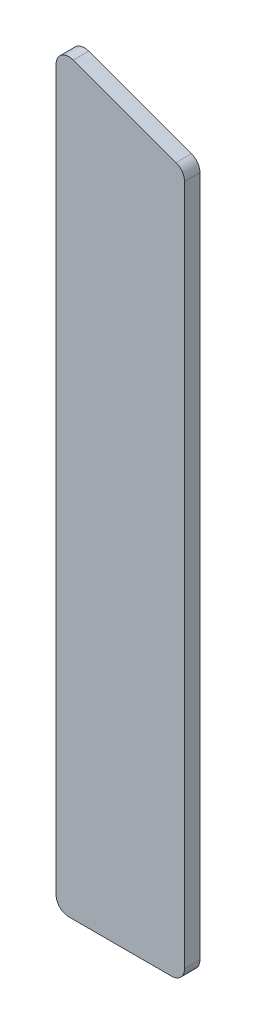
ISO-10303-21;
HEADER;
FILE_DESCRIPTION(('STEP AP214'),'2;1');
FILE_NAME('part.step','',(''),(''),'','','');
FILE_SCHEMA(('AUTOMOTIVE_DESIGN { 1 0 10303 214 1 1 1 1 }'));
ENDSEC;
DATA;
#1=APPLICATION_CONTEXT('core data for automotive mechanical design processes');
#2=APPLICATION_PROTOCOL_DEFINITION('international standard','automotive_design',2000,#1);
#3=PRODUCT_CONTEXT('',#1,'mechanical');
#4=PRODUCT('Part','Part','',(#3));
#5=PRODUCT_RELATED_PRODUCT_CATEGORY('part','',(#4));
#6=PRODUCT_DEFINITION_FORMATION('','',#4);
#7=PRODUCT_DEFINITION_CONTEXT('part definition',#1,'design');
#8=PRODUCT_DEFINITION('design','',#6,#7);
#9=PRODUCT_DEFINITION_SHAPE('','',#8);
#10=(LENGTH_UNIT() NAMED_UNIT(*) SI_UNIT(.MILLI.,.METRE.));
#11=(NAMED_UNIT(*) PLANE_ANGLE_UNIT() SI_UNIT($,.RADIAN.));
#12=(NAMED_UNIT(*) SI_UNIT($,.STERADIAN.) SOLID_ANGLE_UNIT());
#13=UNCERTAINTY_MEASURE_WITH_UNIT(LENGTH_MEASURE(1.E-05),#10,'distance_accuracy_value','');
#14=(GEOMETRIC_REPRESENTATION_CONTEXT(3) GLOBAL_UNCERTAINTY_ASSIGNED_CONTEXT((#13)) GLOBAL_UNIT_ASSIGNED_CONTEXT((#10,
#11,#12)) REPRESENTATION_CONTEXT('',''));
#15=CARTESIAN_POINT('',(0.,0.,0.));
#16=DIRECTION('',(0.,0.,1.));
#17=DIRECTION('',(1.,0.,0.));
#18=AXIS2_PLACEMENT_3D('',#15,#16,#17);
#19=CARTESIAN_POINT('',(20.,5.,6.));
#20=DIRECTION('',(0.,0.,-1.));
#21=DIRECTION('',(-1.,0.,0.));
#22=AXIS2_PLACEMENT_3D('',#19,#20,#21);
#23=CYLINDRICAL_SURFACE('',#22,5.);
#24=CARTESIAN_POINT('',(20.,5.,0.));
#25=DIRECTION('',(0.,0.,1.));
#26=DIRECTION('',(-1.,0.,0.));
#27=AXIS2_PLACEMENT_3D('',#24,#25,#26);
#28=CIRCLE('',#27,5.);
#29=CARTESIAN_POINT('',(20.,0.,0.));
#30=VERTEX_POINT('',#29);
#31=CARTESIAN_POINT('',(25.,5.,0.));
#32=VERTEX_POINT('',#31);
#33=EDGE_CURVE('E135',#30,#32,#28,.T.);
#34=ORIENTED_EDGE('',*,*,#33,.T.);
#35=DIRECTION('',(0.,0.,-1.));
#36=VECTOR('',#35,1.);
#37=CARTESIAN_POINT('',(25.,5.,6.));
#38=LINE('',#37,#36);
#39=CARTESIAN_POINT('',(25.,5.,6.));
#40=VERTEX_POINT('',#39);
#41=EDGE_CURVE('E11',#40,#32,#38,.T.);
#42=ORIENTED_EDGE('',*,*,#41,.F.);
#43=CARTESIAN_POINT('',(20.,5.,6.));
#44=DIRECTION('',(0.,0.,1.));
#45=DIRECTION('',(-1.,0.,0.));
#46=AXIS2_PLACEMENT_3D('',#43,#44,#45);
#47=CIRCLE('',#46,5.);
#48=CARTESIAN_POINT('',(20.,0.,6.));
#49=VERTEX_POINT('',#48);
#50=EDGE_CURVE('E149',#49,#40,#47,.T.);
#51=ORIENTED_EDGE('',*,*,#50,.F.);
#52=DIRECTION('',(0.,0.,-1.));
#53=VECTOR('',#52,1.);
#54=CARTESIAN_POINT('',(20.,0.,6.));
#55=LINE('',#54,#53);
#56=EDGE_CURVE('E131',#49,#30,#55,.T.);
#57=ORIENTED_EDGE('',*,*,#56,.T.);
#58=EDGE_LOOP('',(#34,#42,#51,#57));
#59=FACE_BOUND('',#58,.T.);
#60=ADVANCED_FACE('F39',(#59),#23,.T.);
#61=CARTESIAN_POINT('',(25.,5.,6.));
#62=DIRECTION('',(-1.,0.,0.));
#63=DIRECTION('',(0.,0.,1.));
#64=AXIS2_PLACEMENT_3D('',#61,#62,#63);
#65=PLANE('',#64);
#66=DIRECTION('',(0.,1.,0.));
#67=VECTOR('',#66,1.);
#68=CARTESIAN_POINT('',(25.,5.,0.));
#69=LINE('',#68,#67);
#70=CARTESIAN_POINT('',(25.,270.441190629352,0.));
#71=VERTEX_POINT('',#70);
#72=EDGE_CURVE('E138',#32,#71,#69,.T.);
#73=ORIENTED_EDGE('',*,*,#72,.T.);
#74=DIRECTION('',(0.,0.,-1.));
#75=VECTOR('',#74,1.);
#76=CARTESIAN_POINT('',(25.,270.441190629352,6.));
#77=LINE('',#76,#75);
#78=CARTESIAN_POINT('',(25.,270.441190629352,6.));
#79=VERTEX_POINT('',#78);
#80=EDGE_CURVE('E47',#79,#71,#77,.T.);
#81=ORIENTED_EDGE('',*,*,#80,.F.);
#82=DIRECTION('',(0.,1.,0.));
#83=VECTOR('',#82,1.);
#84=CARTESIAN_POINT('',(25.,5.,6.));
#85=LINE('',#84,#83);
#86=EDGE_CURVE('E98',#40,#79,#85,.T.);
#87=ORIENTED_EDGE('',*,*,#86,.F.);
#88=ORIENTED_EDGE('',*,*,#41,.T.);
#89=EDGE_LOOP('',(#73,#81,#87,#88));
#90=FACE_BOUND('',#89,.T.);
#91=ADVANCED_FACE('F184',(#90),#65,.F.);
#92=CARTESIAN_POINT('',(20.,270.441190629352,6.));
#93=DIRECTION('',(0.,0.,-1.));
#94=DIRECTION('',(-1.,0.,0.));
#95=AXIS2_PLACEMENT_3D('',#92,#93,#94);
#96=CYLINDRICAL_SURFACE('',#95,4.99999999999999);
#97=CARTESIAN_POINT('',(20.,270.441190629352,0.));
#98=DIRECTION('',(0.,0.,1.));
#99=DIRECTION('',(1.,0.,0.));
#100=AXIS2_PLACEMENT_3D('',#97,#98,#99);
#101=CIRCLE('',#100,4.99999999999999);
#102=CARTESIAN_POINT('',(21.7101007166284,275.139653733281,0.));
#103=VERTEX_POINT('',#102);
#104=EDGE_CURVE('E140',#71,#103,#101,.T.);
#105=ORIENTED_EDGE('',*,*,#104,.T.);
#106=DIRECTION('',(0.,0.,-1.));
#107=VECTOR('',#106,1.);
#108=CARTESIAN_POINT('',(21.7101007166284,275.139653733281,6.));
#109=LINE('',#108,#107);
#110=CARTESIAN_POINT('',(21.7101007166284,275.139653733281,6.));
#111=VERTEX_POINT('',#110);
#112=EDGE_CURVE('E156',#111,#103,#109,.T.);
#113=ORIENTED_EDGE('',*,*,#112,.F.);
#114=CARTESIAN_POINT('',(20.,270.441190629352,6.));
#115=DIRECTION('',(0.,0.,1.));
#116=DIRECTION('',(1.,0.,0.));
#117=AXIS2_PLACEMENT_3D('',#114,#115,#116);
#118=CIRCLE('',#117,4.99999999999999);
#119=EDGE_CURVE('E164',#79,#111,#118,.T.);
#120=ORIENTED_EDGE('',*,*,#119,.F.);
#121=ORIENTED_EDGE('',*,*,#80,.T.);
#122=EDGE_LOOP('',(#105,#113,#120,#121));
#123=FACE_BOUND('',#122,.T.);
#124=ADVANCED_FACE('F162',(#123),#96,.T.);
#125=CARTESIAN_POINT('',(-18.2898992833716,289.698463103929,6.));
#126=DIRECTION('',(-0.342020143325673,-0.939692620785907,0.));
#127=DIRECTION('',(0.939692620785907,-0.342020143325673,0.));
#128=AXIS2_PLACEMENT_3D('',#125,#126,#127);
#129=PLANE('',#128);
#130=DIRECTION('',(-0.939692620785907,0.342020143325673,0.));
#131=VECTOR('',#130,1.);
#132=CARTESIAN_POINT('',(-18.2898992833716,289.698463103929,0.));
#133=LINE('',#132,#131);
#134=CARTESIAN_POINT('',(-18.2898992833716,289.698463103929,0.));
#135=VERTEX_POINT('',#134);
#136=EDGE_CURVE('E142',#103,#135,#133,.T.);
#137=ORIENTED_EDGE('',*,*,#136,.T.);
#138=DIRECTION('',(0.,0.,-1.));
#139=VECTOR('',#138,1.);
#140=CARTESIAN_POINT('',(-18.2898992833716,289.698463103929,6.));
#141=LINE('',#140,#139);
#142=CARTESIAN_POINT('',(-18.2898992833716,289.698463103929,6.));
#143=VERTEX_POINT('',#142);
#144=EDGE_CURVE('E153',#143,#135,#141,.T.);
#145=ORIENTED_EDGE('',*,*,#144,.F.);
#146=DIRECTION('',(-0.939692620785907,0.342020143325673,0.));
#147=VECTOR('',#146,1.);
#148=CARTESIAN_POINT('',(-18.2898992833716,289.698463103929,6.));
#149=LINE('',#148,#147);
#150=EDGE_CURVE('E176',#111,#143,#149,.T.);
#151=ORIENTED_EDGE('',*,*,#150,.F.);
#152=ORIENTED_EDGE('',*,*,#112,.T.);
#153=EDGE_LOOP('',(#137,#145,#151,#152));
#154=FACE_BOUND('',#153,.T.);
#155=ADVANCED_FACE('F172',(#154),#129,.F.);
#156=CARTESIAN_POINT('',(-20.,285.,6.));
#157=DIRECTION('',(0.,0.,-1.));
#158=DIRECTION('',(-1.,0.,0.));
#159=AXIS2_PLACEMENT_3D('',#156,#157,#158);
#160=CYLINDRICAL_SURFACE('',#159,4.99999999999999);
#161=CARTESIAN_POINT('',(-20.,285.,0.));
#162=DIRECTION('',(0.,0.,1.));
#163=DIRECTION('',(1.,0.,0.));
#164=AXIS2_PLACEMENT_3D('',#161,#162,#163);
#165=CIRCLE('',#164,4.99999999999999);
#166=CARTESIAN_POINT('',(-25.,285.,0.));
#167=VERTEX_POINT('',#166);
#168=EDGE_CURVE('E144',#135,#167,#165,.T.);
#169=ORIENTED_EDGE('',*,*,#168,.T.);
#170=DIRECTION('',(0.,0.,-1.));
#171=VECTOR('',#170,1.);
#172=CARTESIAN_POINT('',(-25.,285.,6.));
#173=LINE('',#172,#171);
#174=CARTESIAN_POINT('',(-25.,285.,6.));
#175=VERTEX_POINT('',#174);
#176=EDGE_CURVE('E126',#175,#167,#173,.T.);
#177=ORIENTED_EDGE('',*,*,#176,.F.);
#178=CARTESIAN_POINT('',(-20.,285.,6.));
#179=DIRECTION('',(0.,0.,1.));
#180=DIRECTION('',(1.,0.,0.));
#181=AXIS2_PLACEMENT_3D('',#178,#179,#180);
#182=CIRCLE('',#181,4.99999999999999);
#183=EDGE_CURVE('E117',#143,#175,#182,.T.);
#184=ORIENTED_EDGE('',*,*,#183,.F.);
#185=ORIENTED_EDGE('',*,*,#144,.T.);
#186=EDGE_LOOP('',(#169,#177,#184,#185));
#187=FACE_BOUND('',#186,.T.);
#188=ADVANCED_FACE('F175',(#187),#160,.T.);
#189=CARTESIAN_POINT('',(-25.,5.,6.));
#190=DIRECTION('',(1.,0.,0.));
#191=DIRECTION('',(0.,0.,-1.));
#192=AXIS2_PLACEMENT_3D('',#189,#190,#191);
#193=PLANE('',#192);
#194=DIRECTION('',(0.,-1.,0.));
#195=VECTOR('',#194,1.);
#196=CARTESIAN_POINT('',(-25.,5.,0.));
#197=LINE('',#196,#195);
#198=CARTESIAN_POINT('',(-25.,5.,0.));
#199=VERTEX_POINT('',#198);
#200=EDGE_CURVE('E125',#167,#199,#197,.T.);
#201=ORIENTED_EDGE('',*,*,#200,.T.);
#202=DIRECTION('',(0.,0.,-1.));
#203=VECTOR('',#202,1.);
#204=CARTESIAN_POINT('',(-25.,5.,6.));
#205=LINE('',#204,#203);
#206=CARTESIAN_POINT('',(-25.,5.,6.));
#207=VERTEX_POINT('',#206);
#208=EDGE_CURVE('E122',#207,#199,#205,.T.);
#209=ORIENTED_EDGE('',*,*,#208,.F.);
#210=DIRECTION('',(0.,-1.,0.));
#211=VECTOR('',#210,1.);
#212=CARTESIAN_POINT('',(-25.,5.,6.));
#213=LINE('',#212,#211);
#214=EDGE_CURVE('E111',#175,#207,#213,.T.);
#215=ORIENTED_EDGE('',*,*,#214,.F.);
#216=ORIENTED_EDGE('',*,*,#176,.T.);
#217=EDGE_LOOP('',(#201,#209,#215,#216));
#218=FACE_BOUND('',#217,.T.);
#219=ADVANCED_FACE('F123',(#218),#193,.F.);
#220=CARTESIAN_POINT('',(-20.,5.,6.));
#221=DIRECTION('',(0.,0.,-1.));
#222=DIRECTION('',(-1.,0.,0.));
#223=AXIS2_PLACEMENT_3D('',#220,#221,#222);
#224=CYLINDRICAL_SURFACE('',#223,5.);
#225=CARTESIAN_POINT('',(-20.,5.,0.));
#226=DIRECTION('',(0.,0.,1.));
#227=DIRECTION('',(1.,0.,0.));
#228=AXIS2_PLACEMENT_3D('',#225,#226,#227);
#229=CIRCLE('',#228,5.);
#230=CARTESIAN_POINT('',(-20.,0.,0.));
#231=VERTEX_POINT('',#230);
#232=EDGE_CURVE('E84',#199,#231,#229,.T.);
#233=ORIENTED_EDGE('',*,*,#232,.T.);
#234=DIRECTION('',(0.,0.,-1.));
#235=VECTOR('',#234,1.);
#236=CARTESIAN_POINT('',(-20.,0.,6.));
#237=LINE('',#236,#235);
#238=CARTESIAN_POINT('',(-20.,0.,6.));
#239=VERTEX_POINT('',#238);
#240=EDGE_CURVE('E127',#239,#231,#237,.T.);
#241=ORIENTED_EDGE('',*,*,#240,.F.);
#242=CARTESIAN_POINT('',(-20.,5.,6.));
#243=DIRECTION('',(0.,0.,1.));
#244=DIRECTION('',(1.,0.,0.));
#245=AXIS2_PLACEMENT_3D('',#242,#243,#244);
#246=CIRCLE('',#245,5.);
#247=EDGE_CURVE('E115',#207,#239,#246,.T.);
#248=ORIENTED_EDGE('',*,*,#247,.F.);
#249=ORIENTED_EDGE('',*,*,#208,.T.);
#250=EDGE_LOOP('',(#233,#241,#248,#249));
#251=FACE_BOUND('',#250,.T.);
#252=ADVANCED_FACE('F129',(#251),#224,.T.);
#253=CARTESIAN_POINT('',(-20.,0.,6.));
#254=DIRECTION('',(0.,1.,0.));
#255=DIRECTION('',(0.,0.,1.));
#256=AXIS2_PLACEMENT_3D('',#253,#254,#255);
#257=PLANE('',#256);
#258=DIRECTION('',(1.,0.,0.));
#259=VECTOR('',#258,1.);
#260=CARTESIAN_POINT('',(-20.,0.,0.));
#261=LINE('',#260,#259);
#262=EDGE_CURVE('E90',#231,#30,#261,.T.);
#263=ORIENTED_EDGE('',*,*,#262,.T.);
#264=ORIENTED_EDGE('',*,*,#56,.F.);
#265=DIRECTION('',(1.,0.,0.));
#266=VECTOR('',#265,1.);
#267=CARTESIAN_POINT('',(-20.,0.,6.));
#268=LINE('',#267,#266);
#269=EDGE_CURVE('E55',#239,#49,#268,.T.);
#270=ORIENTED_EDGE('',*,*,#269,.F.);
#271=ORIENTED_EDGE('',*,*,#240,.T.);
#272=EDGE_LOOP('',(#263,#264,#270,#271));
#273=FACE_BOUND('',#272,.T.);
#274=ADVANCED_FACE('F200',(#273),#257,.F.);
#275=CARTESIAN_POINT('',(20.,5.,6.));
#276=DIRECTION('',(0.,0.,-1.));
#277=DIRECTION('',(-1.,0.,0.));
#278=AXIS2_PLACEMENT_3D('',#275,#276,#277);
#279=PLANE('',#278);
#280=ORIENTED_EDGE('',*,*,#50,.T.);
#281=ORIENTED_EDGE('',*,*,#86,.T.);
#282=ORIENTED_EDGE('',*,*,#119,.T.);
#283=ORIENTED_EDGE('',*,*,#150,.T.);
#284=ORIENTED_EDGE('',*,*,#183,.T.);
#285=ORIENTED_EDGE('',*,*,#214,.T.);
#286=ORIENTED_EDGE('',*,*,#247,.T.);
#287=ORIENTED_EDGE('',*,*,#269,.T.);
#288=EDGE_LOOP('',(#280,#281,#282,#283,#284,#285,#286,#287));
#289=FACE_BOUND('',#288,.T.);
#290=ADVANCED_FACE('F113',(#289),#279,.F.);
#291=CARTESIAN_POINT('',(20.,5.,0.));
#292=DIRECTION('',(0.,0.,-1.));
#293=DIRECTION('',(-1.,0.,0.));
#294=AXIS2_PLACEMENT_3D('',#291,#292,#293);
#295=PLANE('',#294);
#296=ORIENTED_EDGE('',*,*,#33,.F.);
#297=ORIENTED_EDGE('',*,*,#262,.F.);
#298=ORIENTED_EDGE('',*,*,#232,.F.);
#299=ORIENTED_EDGE('',*,*,#200,.F.);
#300=ORIENTED_EDGE('',*,*,#168,.F.);
#301=ORIENTED_EDGE('',*,*,#136,.F.);
#302=ORIENTED_EDGE('',*,*,#104,.F.);
#303=ORIENTED_EDGE('',*,*,#72,.F.);
#304=EDGE_LOOP('',(#296,#297,#298,#299,#300,#301,#302,#303));
#305=FACE_BOUND('',#304,.T.);
#306=ADVANCED_FACE('F168',(#305),#295,.T.);
#307=CLOSED_SHELL('',(#60,#91,#124,#155,#188,#219,#252,#274,#290,#306));
#308=MANIFOLD_SOLID_BREP('B2',#307);
#309=ADVANCED_BREP_SHAPE_REPRESENTATION('',(#18,#308),#14);
#310=SHAPE_DEFINITION_REPRESENTATION(#9,#309);
ENDSEC;
END-ISO-10303-21;
